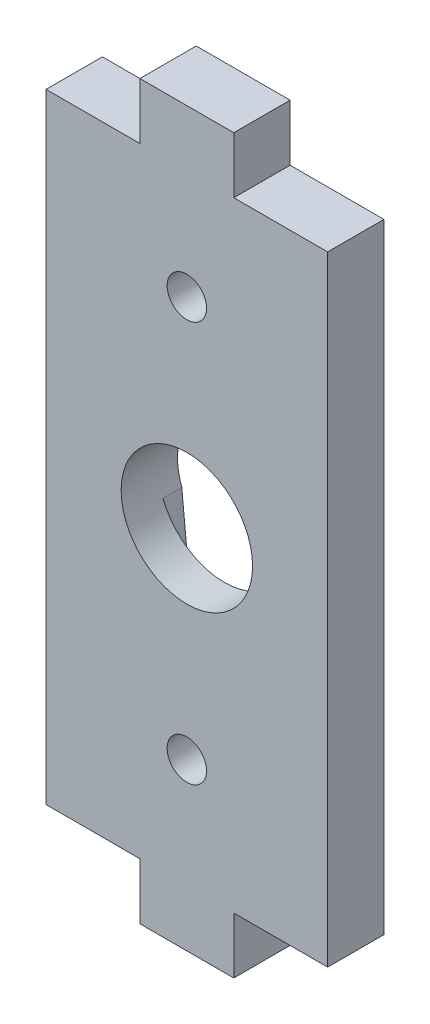
ISO-10303-21;
HEADER;
FILE_DESCRIPTION(('STEP AP214'),'2;1');
FILE_NAME('part.step','',(''),(''),'','','');
FILE_SCHEMA(('AUTOMOTIVE_DESIGN { 1 0 10303 214 1 1 1 1 }'));
ENDSEC;
DATA;
#1=APPLICATION_CONTEXT('core data for automotive mechanical design processes');
#2=APPLICATION_PROTOCOL_DEFINITION('international standard','automotive_design',2000,#1);
#3=PRODUCT_CONTEXT('',#1,'mechanical');
#4=PRODUCT('Part','Part','',(#3));
#5=PRODUCT_RELATED_PRODUCT_CATEGORY('part','',(#4));
#6=PRODUCT_DEFINITION_FORMATION('','',#4);
#7=PRODUCT_DEFINITION_CONTEXT('part definition',#1,'design');
#8=PRODUCT_DEFINITION('design','',#6,#7);
#9=PRODUCT_DEFINITION_SHAPE('','',#8);
#10=(LENGTH_UNIT() NAMED_UNIT(*) SI_UNIT(.MILLI.,.METRE.));
#11=(NAMED_UNIT(*) PLANE_ANGLE_UNIT() SI_UNIT($,.RADIAN.));
#12=(NAMED_UNIT(*) SI_UNIT($,.STERADIAN.) SOLID_ANGLE_UNIT());
#13=UNCERTAINTY_MEASURE_WITH_UNIT(LENGTH_MEASURE(1.E-05),#10,'distance_accuracy_value','');
#14=(GEOMETRIC_REPRESENTATION_CONTEXT(3) GLOBAL_UNCERTAINTY_ASSIGNED_CONTEXT((#13)) GLOBAL_UNIT_ASSIGNED_CONTEXT((#10,
#11,#12)) REPRESENTATION_CONTEXT('',''));
#15=CARTESIAN_POINT('',(0.,0.,0.));
#16=DIRECTION('',(0.,0.,1.));
#17=DIRECTION('',(1.,0.,0.));
#18=AXIS2_PLACEMENT_3D('',#15,#16,#17);
#19=CARTESIAN_POINT('',(0.,0.,0.));
#20=DIRECTION('',(0.,0.,1.));
#21=DIRECTION('',(1.,0.,0.));
#22=AXIS2_PLACEMENT_3D('',#19,#20,#21);
#23=PLANE('',#22);
#24=DIRECTION('',(0.,-1.,0.));
#25=VECTOR('',#24,1.);
#26=CARTESIAN_POINT('',(49.5000000000004,13.4999999999995,0.));
#27=LINE('',#26,#25);
#28=CARTESIAN_POINT('',(49.5000000000004,13.4999999999995,0.));
#29=VERTEX_POINT('',#28);
#30=CARTESIAN_POINT('',(49.5000000000004,10.4999999999995,0.));
#31=VERTEX_POINT('',#30);
#32=EDGE_CURVE('E247',#29,#31,#27,.T.);
#33=ORIENTED_EDGE('',*,*,#32,.F.);
#34=DIRECTION('',(1.,0.,0.));
#35=VECTOR('',#34,1.);
#36=CARTESIAN_POINT('',(44.4999999999995,13.4999999999995,0.));
#37=LINE('',#36,#35);
#38=CARTESIAN_POINT('',(44.4999999999995,13.4999999999995,0.));
#39=VERTEX_POINT('',#38);
#40=EDGE_CURVE('E252',#39,#29,#37,.T.);
#41=ORIENTED_EDGE('',*,*,#40,.F.);
#42=DIRECTION('',(0.,-1.,0.));
#43=VECTOR('',#42,1.);
#44=CARTESIAN_POINT('',(44.4999999999995,23.4999999999996,0.));
#45=LINE('',#44,#43);
#46=CARTESIAN_POINT('',(44.4999999999995,46.5000000000005,0.));
#47=VERTEX_POINT('',#46);
#48=EDGE_CURVE('E297',#47,#39,#45,.T.);
#49=ORIENTED_EDGE('',*,*,#48,.F.);
#50=DIRECTION('',(-1.,0.,0.));
#51=VECTOR('',#50,1.);
#52=CARTESIAN_POINT('',(49.5000000000004,46.5000000000005,0.));
#53=LINE('',#52,#51);
#54=CARTESIAN_POINT('',(49.5000000000004,46.5000000000005,0.));
#55=VERTEX_POINT('',#54);
#56=EDGE_CURVE('E294',#55,#47,#53,.T.);
#57=ORIENTED_EDGE('',*,*,#56,.F.);
#58=DIRECTION('',(0.,-1.,0.));
#59=VECTOR('',#58,1.);
#60=CARTESIAN_POINT('',(49.5000000000004,49.5000000000005,0.));
#61=LINE('',#60,#59);
#62=CARTESIAN_POINT('',(49.5000000000004,49.5000000000005,0.));
#63=VERTEX_POINT('',#62);
#64=EDGE_CURVE('E292',#63,#55,#61,.T.);
#65=ORIENTED_EDGE('',*,*,#64,.F.);
#66=DIRECTION('',(-1.,0.,0.));
#67=VECTOR('',#66,1.);
#68=CARTESIAN_POINT('',(54.5000000000005,49.5000000000005,0.));
#69=LINE('',#68,#67);
#70=CARTESIAN_POINT('',(54.5000000000005,49.5000000000005,0.));
#71=VERTEX_POINT('',#70);
#72=EDGE_CURVE('E290',#71,#63,#69,.T.);
#73=ORIENTED_EDGE('',*,*,#72,.F.);
#74=DIRECTION('',(0.,1.,0.));
#75=VECTOR('',#74,1.);
#76=CARTESIAN_POINT('',(54.5000000000005,46.5000000000005,0.));
#77=LINE('',#76,#75);
#78=CARTESIAN_POINT('',(54.5000000000005,46.5000000000005,0.));
#79=VERTEX_POINT('',#78);
#80=EDGE_CURVE('E288',#79,#71,#77,.T.);
#81=ORIENTED_EDGE('',*,*,#80,.F.);
#82=DIRECTION('',(-1.,0.,0.));
#83=VECTOR('',#82,1.);
#84=CARTESIAN_POINT('',(59.5000000000005,46.5000000000005,0.));
#85=LINE('',#84,#83);
#86=CARTESIAN_POINT('',(59.5000000000005,46.5000000000005,0.));
#87=VERTEX_POINT('',#86);
#88=EDGE_CURVE('E286',#87,#79,#85,.T.);
#89=ORIENTED_EDGE('',*,*,#88,.F.);
#90=DIRECTION('',(0.,1.,0.));
#91=VECTOR('',#90,1.);
#92=CARTESIAN_POINT('',(59.5000000000005,29.5000000000001,0.));
#93=LINE('',#92,#91);
#94=CARTESIAN_POINT('',(59.5000000000005,13.4999999999995,0.));
#95=VERTEX_POINT('',#94);
#96=EDGE_CURVE('E284',#95,#87,#93,.T.);
#97=ORIENTED_EDGE('',*,*,#96,.F.);
#98=DIRECTION('',(1.,0.,0.));
#99=VECTOR('',#98,1.);
#100=CARTESIAN_POINT('',(54.5000000000005,13.4999999999995,0.));
#101=LINE('',#100,#99);
#102=CARTESIAN_POINT('',(54.5000000000005,13.4999999999995,0.));
#103=VERTEX_POINT('',#102);
#104=EDGE_CURVE('E281',#103,#95,#101,.T.);
#105=ORIENTED_EDGE('',*,*,#104,.F.);
#106=DIRECTION('',(0.,1.,0.));
#107=VECTOR('',#106,1.);
#108=CARTESIAN_POINT('',(54.5000000000005,10.4999999999995,0.));
#109=LINE('',#108,#107);
#110=CARTESIAN_POINT('',(54.5000000000005,10.4999999999995,0.));
#111=VERTEX_POINT('',#110);
#112=EDGE_CURVE('E279',#111,#103,#109,.T.);
#113=ORIENTED_EDGE('',*,*,#112,.F.);
#114=DIRECTION('',(1.,0.,0.));
#115=VECTOR('',#114,1.);
#116=CARTESIAN_POINT('',(49.5000000000004,10.4999999999995,0.));
#117=LINE('',#116,#115);
#118=EDGE_CURVE('E277',#31,#111,#117,.T.);
#119=ORIENTED_EDGE('',*,*,#118,.F.);
#120=EDGE_LOOP('',(#33,#41,#49,#57,#65,#73,#81,#89,#97,#105,#113,#119));
#121=FACE_BOUND('',#120,.T.);
#122=DIRECTION('',(-0.0983012262714599,0.995156705706959,0.));
#123=VECTOR('',#122,1.);
#124=CARTESIAN_POINT('',(55.2691742077414,31.2499999998536,0.));
#125=LINE('',#124,#123);
#126=CARTESIAN_POINT('',(55.2691742077414,31.2499999998536,0.));
#127=VERTEX_POINT('',#126);
#128=CARTESIAN_POINT('',(53.9903134114006,44.1966024525005,0.));
#129=VERTEX_POINT('',#128);
#130=EDGE_CURVE('E197',#127,#129,#125,.T.);
#131=ORIENTED_EDGE('',*,*,#130,.T.);
#132=CARTESIAN_POINT('',(51.9999999999917,43.9999999999867,0.));
#133=DIRECTION('',(0.,0.,1.));
#134=DIRECTION('',(1.,0.,0.));
#135=AXIS2_PLACEMENT_3D('',#132,#133,#134);
#136=CIRCLE('',#135,1.99999999999214);
#137=CARTESIAN_POINT('',(49.9999999999995,43.9999999999867,0.));
#138=VERTEX_POINT('',#137);
#139=EDGE_CURVE('E185',#129,#138,#136,.T.);
#140=ORIENTED_EDGE('',*,*,#139,.T.);
#141=DIRECTION('',(-0.0990535328157976,-0.995082105977547,0.));
#142=VECTOR('',#141,1.);
#143=CARTESIAN_POINT('',(49.9999999999995,43.9999999999867,0.));
#144=LINE('',#143,#142);
#145=CARTESIAN_POINT('',(48.7308257923483,31.249999999981,0.));
#146=VERTEX_POINT('',#145);
#147=EDGE_CURVE('E200',#138,#146,#144,.T.);
#148=ORIENTED_EDGE('',*,*,#147,.T.);
#149=CARTESIAN_POINT('',(52.0000000000004,29.9999999999997,0.));
#150=DIRECTION('',(0.,0.,1.));
#151=DIRECTION('',(1.,0.,0.));
#152=AXIS2_PLACEMENT_3D('',#149,#150,#151);
#153=CIRCLE('',#152,3.5);
#154=CARTESIAN_POINT('',(48.7308257922595,28.7500000001457,0.));
#155=VERTEX_POINT('',#154);
#156=EDGE_CURVE('E234',#146,#155,#153,.T.);
#157=ORIENTED_EDGE('',*,*,#156,.T.);
#158=DIRECTION('',(0.0967980247525767,-0.995304045206287,0.));
#159=VECTOR('',#158,1.);
#160=CARTESIAN_POINT('',(48.7308257922595,28.7500000001457,0.));
#161=LINE('',#160,#159);
#162=CARTESIAN_POINT('',(49.9999999999995,15.7000000000006,0.));
#163=VERTEX_POINT('',#162);
#164=EDGE_CURVE('E217',#155,#163,#161,.T.);
#165=ORIENTED_EDGE('',*,*,#164,.T.);
#166=CARTESIAN_POINT('',(51.9999999999999,15.7000000000006,0.));
#167=DIRECTION('',(0.,0.,1.));
#168=DIRECTION('',(1.,0.,0.));
#169=AXIS2_PLACEMENT_3D('',#166,#167,#168);
#170=CIRCLE('',#169,2.00000000000042);
#171=CARTESIAN_POINT('',(54.0000000000004,15.7000000000006,0.));
#172=VERTEX_POINT('',#171);
#173=EDGE_CURVE('E220',#163,#172,#170,.T.);
#174=ORIENTED_EDGE('',*,*,#173,.T.);
#175=DIRECTION('',(0.0967980247467391,0.995304045206855,0.));
#176=VECTOR('',#175,1.);
#177=CARTESIAN_POINT('',(54.0000000000004,15.7000000000006,0.));
#178=LINE('',#177,#176);
#179=CARTESIAN_POINT('',(55.2691742076508,28.7500000000182,0.));
#180=VERTEX_POINT('',#179);
#181=EDGE_CURVE('E210',#172,#180,#178,.T.);
#182=ORIENTED_EDGE('',*,*,#181,.T.);
#183=EDGE_CURVE('E239',#180,#127,#153,.T.);
#184=ORIENTED_EDGE('',*,*,#183,.T.);
#185=EDGE_LOOP('',(#131,#140,#148,#157,#165,#174,#182,#184));
#186=FACE_BOUND('',#185,.T.);
#187=ADVANCED_FACE('F33',(#121,#186),#23,.F.);
#188=CARTESIAN_POINT('',(52.0000000000004,29.9999999999997,3.));
#189=DIRECTION('',(0.,0.,-1.));
#190=DIRECTION('',(-1.,0.,0.));
#191=AXIS2_PLACEMENT_3D('',#188,#189,#190);
#192=CYLINDRICAL_SURFACE('',#191,3.5);
#193=CARTESIAN_POINT('',(52.0000000000004,29.9999999999997,3.));
#194=DIRECTION('',(0.,0.,1.));
#195=DIRECTION('',(1.,0.,0.));
#196=AXIS2_PLACEMENT_3D('',#193,#194,#195);
#197=CIRCLE('',#196,3.5);
#198=CARTESIAN_POINT('',(55.5000000000004,29.9999999999997,3.));
#199=VERTEX_POINT('',#198);
#200=EDGE_CURVE('E235',#199,#199,#197,.T.);
#201=ORIENTED_EDGE('',*,*,#200,.T.);
#202=EDGE_LOOP('',(#201));
#203=FACE_BOUND('',#202,.T.);
#204=CARTESIAN_POINT('',(51.9999999999795,29.9999999999416,1.));
#205=DIRECTION('',(0.,0.,-1.));
#206=DIRECTION('',(1.,0.,0.));
#207=AXIS2_PLACEMENT_3D('',#204,#205,#206);
#208=CIRCLE('',#207,3.50000000002966);
#209=CARTESIAN_POINT('',(48.7308257923483,31.249999999981,1.));
#210=VERTEX_POINT('',#209);
#211=CARTESIAN_POINT('',(55.2691742077155,31.2499999998437,1.));
#212=VERTEX_POINT('',#211);
#213=EDGE_CURVE('E179',#210,#212,#208,.T.);
#214=ORIENTED_EDGE('',*,*,#213,.T.);
#215=DIRECTION('',(0.,0.,-1.));
#216=VECTOR('',#215,1.);
#217=CARTESIAN_POINT('',(55.2691742077414,31.2499999998536,1.));
#218=LINE('',#217,#216);
#219=EDGE_CURVE('E49',#212,#127,#218,.T.);
#220=ORIENTED_EDGE('',*,*,#219,.T.);
#221=ORIENTED_EDGE('',*,*,#183,.F.);
#222=DIRECTION('',(0.,0.,-1.));
#223=VECTOR('',#222,1.);
#224=CARTESIAN_POINT('',(55.2691742076508,28.7500000000182,1.));
#225=LINE('',#224,#223);
#226=CARTESIAN_POINT('',(55.2691742076508,28.7500000000182,1.));
#227=VERTEX_POINT('',#226);
#228=EDGE_CURVE('E216',#227,#180,#225,.T.);
#229=ORIENTED_EDGE('',*,*,#228,.F.);
#230=CARTESIAN_POINT('',(51.9999999999795,29.9999999999416,1.));
#231=DIRECTION('',(0.,0.,-1.));
#232=DIRECTION('',(1.,0.,0.));
#233=AXIS2_PLACEMENT_3D('',#230,#231,#232);
#234=CIRCLE('',#233,3.49999999998736);
#235=CARTESIAN_POINT('',(48.7308257922853,28.7500000001555,1.));
#236=VERTEX_POINT('',#235);
#237=EDGE_CURVE('E206',#227,#236,#234,.T.);
#238=ORIENTED_EDGE('',*,*,#237,.T.);
#239=DIRECTION('',(0.,0.,-1.));
#240=VECTOR('',#239,1.);
#241=CARTESIAN_POINT('',(48.7308257922595,28.7500000001457,1.));
#242=LINE('',#241,#240);
#243=EDGE_CURVE('E57',#236,#155,#242,.T.);
#244=ORIENTED_EDGE('',*,*,#243,.T.);
#245=ORIENTED_EDGE('',*,*,#156,.F.);
#246=DIRECTION('',(0.,0.,-1.));
#247=VECTOR('',#246,1.);
#248=CARTESIAN_POINT('',(48.7308257923483,31.249999999981,1.));
#249=LINE('',#248,#247);
#250=EDGE_CURVE('E193',#210,#146,#249,.T.);
#251=ORIENTED_EDGE('',*,*,#250,.F.);
#252=EDGE_LOOP('',(#214,#220,#221,#229,#238,#244,#245,#251));
#253=FACE_BOUND('',#252,.T.);
#254=ADVANCED_FACE('F399',(#203,#253),#192,.F.);
#255=CARTESIAN_POINT('',(0.,0.,3.));
#256=DIRECTION('',(0.,0.,1.));
#257=DIRECTION('',(1.,0.,0.));
#258=AXIS2_PLACEMENT_3D('',#255,#256,#257);
#259=PLANE('',#258);
#260=CARTESIAN_POINT('',(52.0000000000004,19.3277705465005,3.));
#261=DIRECTION('',(0.,0.,1.));
#262=DIRECTION('',(1.,0.,0.));
#263=AXIS2_PLACEMENT_3D('',#260,#261,#262);
#264=CIRCLE('',#263,1.05);
#265=CARTESIAN_POINT('',(53.0500000000004,19.3277705465005,3.));
#266=VERTEX_POINT('',#265);
#267=EDGE_CURVE('E238',#266,#266,#264,.T.);
#268=ORIENTED_EDGE('',*,*,#267,.F.);
#269=EDGE_LOOP('',(#268));
#270=FACE_BOUND('',#269,.T.);
#271=DIRECTION('',(0.,-1.,0.));
#272=VECTOR('',#271,1.);
#273=CARTESIAN_POINT('',(49.5000000000004,13.4999999999995,3.));
#274=LINE('',#273,#272);
#275=CARTESIAN_POINT('',(49.5000000000004,13.4999999999995,3.));
#276=VERTEX_POINT('',#275);
#277=CARTESIAN_POINT('',(49.5000000000004,10.4999999999995,3.));
#278=VERTEX_POINT('',#277);
#279=EDGE_CURVE('E248',#276,#278,#274,.T.);
#280=ORIENTED_EDGE('',*,*,#279,.T.);
#281=DIRECTION('',(1.,0.,0.));
#282=VECTOR('',#281,1.);
#283=CARTESIAN_POINT('',(49.5000000000004,10.4999999999995,3.));
#284=LINE('',#283,#282);
#285=CARTESIAN_POINT('',(54.5000000000005,10.4999999999995,3.));
#286=VERTEX_POINT('',#285);
#287=EDGE_CURVE('E251',#278,#286,#284,.T.);
#288=ORIENTED_EDGE('',*,*,#287,.T.);
#289=DIRECTION('',(0.,1.,0.));
#290=VECTOR('',#289,1.);
#291=CARTESIAN_POINT('',(54.5000000000005,10.4999999999995,3.));
#292=LINE('',#291,#290);
#293=CARTESIAN_POINT('',(54.5000000000005,13.4999999999995,3.));
#294=VERTEX_POINT('',#293);
#295=EDGE_CURVE('E254',#286,#294,#292,.T.);
#296=ORIENTED_EDGE('',*,*,#295,.T.);
#297=DIRECTION('',(1.,0.,0.));
#298=VECTOR('',#297,1.);
#299=CARTESIAN_POINT('',(54.5000000000005,13.4999999999995,3.));
#300=LINE('',#299,#298);
#301=CARTESIAN_POINT('',(59.5000000000005,13.4999999999995,3.));
#302=VERTEX_POINT('',#301);
#303=EDGE_CURVE('E256',#294,#302,#300,.T.);
#304=ORIENTED_EDGE('',*,*,#303,.T.);
#305=DIRECTION('',(0.,1.,0.));
#306=VECTOR('',#305,1.);
#307=CARTESIAN_POINT('',(59.5000000000005,13.4999999999995,3.));
#308=LINE('',#307,#306);
#309=CARTESIAN_POINT('',(59.5000000000005,46.5000000000005,3.));
#310=VERTEX_POINT('',#309);
#311=EDGE_CURVE('E258',#302,#310,#308,.T.);
#312=ORIENTED_EDGE('',*,*,#311,.T.);
#313=DIRECTION('',(-1.,0.,0.));
#314=VECTOR('',#313,1.);
#315=CARTESIAN_POINT('',(59.5000000000005,46.5000000000005,3.));
#316=LINE('',#315,#314);
#317=CARTESIAN_POINT('',(54.5000000000005,46.5000000000005,3.));
#318=VERTEX_POINT('',#317);
#319=EDGE_CURVE('E260',#310,#318,#316,.T.);
#320=ORIENTED_EDGE('',*,*,#319,.T.);
#321=DIRECTION('',(0.,1.,0.));
#322=VECTOR('',#321,1.);
#323=CARTESIAN_POINT('',(54.5000000000005,46.5000000000005,3.));
#324=LINE('',#323,#322);
#325=CARTESIAN_POINT('',(54.5000000000005,49.5000000000005,3.));
#326=VERTEX_POINT('',#325);
#327=EDGE_CURVE('E262',#318,#326,#324,.T.);
#328=ORIENTED_EDGE('',*,*,#327,.T.);
#329=DIRECTION('',(-1.,0.,0.));
#330=VECTOR('',#329,1.);
#331=CARTESIAN_POINT('',(54.5000000000005,49.5000000000005,3.));
#332=LINE('',#331,#330);
#333=CARTESIAN_POINT('',(49.5000000000004,49.5000000000005,3.));
#334=VERTEX_POINT('',#333);
#335=EDGE_CURVE('E264',#326,#334,#332,.T.);
#336=ORIENTED_EDGE('',*,*,#335,.T.);
#337=DIRECTION('',(0.,-1.,0.));
#338=VECTOR('',#337,1.);
#339=CARTESIAN_POINT('',(49.5000000000004,49.5000000000005,3.));
#340=LINE('',#339,#338);
#341=CARTESIAN_POINT('',(49.5000000000004,46.5000000000005,3.));
#342=VERTEX_POINT('',#341);
#343=EDGE_CURVE('E266',#334,#342,#340,.T.);
#344=ORIENTED_EDGE('',*,*,#343,.T.);
#345=DIRECTION('',(-1.,0.,0.));
#346=VECTOR('',#345,1.);
#347=CARTESIAN_POINT('',(49.5000000000004,46.5000000000005,3.));
#348=LINE('',#347,#346);
#349=CARTESIAN_POINT('',(44.4999999999995,46.5000000000005,3.));
#350=VERTEX_POINT('',#349);
#351=EDGE_CURVE('E268',#342,#350,#348,.T.);
#352=ORIENTED_EDGE('',*,*,#351,.T.);
#353=DIRECTION('',(0.,-1.,0.));
#354=VECTOR('',#353,1.);
#355=CARTESIAN_POINT('',(44.4999999999995,46.5000000000005,3.));
#356=LINE('',#355,#354);
#357=CARTESIAN_POINT('',(44.4999999999995,13.4999999999995,3.));
#358=VERTEX_POINT('',#357);
#359=EDGE_CURVE('E270',#350,#358,#356,.T.);
#360=ORIENTED_EDGE('',*,*,#359,.T.);
#361=DIRECTION('',(1.,0.,0.));
#362=VECTOR('',#361,1.);
#363=CARTESIAN_POINT('',(44.4999999999995,13.4999999999995,3.));
#364=LINE('',#363,#362);
#365=EDGE_CURVE('E272',#358,#276,#364,.T.);
#366=ORIENTED_EDGE('',*,*,#365,.T.);
#367=EDGE_LOOP('',(#280,#288,#296,#304,#312,#320,#328,#336,#344,#352,#360,#366));
#368=FACE_BOUND('',#367,.T.);
#369=CARTESIAN_POINT('',(52.0000000000004,40.6722294535005,3.));
#370=DIRECTION('',(0.,0.,1.));
#371=DIRECTION('',(1.,0.,0.));
#372=AXIS2_PLACEMENT_3D('',#369,#370,#371);
#373=CIRCLE('',#372,1.05);
#374=CARTESIAN_POINT('',(53.0500000000004,40.6722294535005,3.));
#375=VERTEX_POINT('',#374);
#376=EDGE_CURVE('E244',#375,#375,#373,.T.);
#377=ORIENTED_EDGE('',*,*,#376,.F.);
#378=EDGE_LOOP('',(#377));
#379=FACE_BOUND('',#378,.T.);
#380=ORIENTED_EDGE('',*,*,#200,.F.);
#381=EDGE_LOOP('',(#380));
#382=FACE_BOUND('',#381,.T.);
#383=ADVANCED_FACE('F352',(#270,#368,#379,#382),#259,.T.);
#384=CARTESIAN_POINT('',(49.5000000000004,13.4999999999995,3.));
#385=DIRECTION('',(1.,0.,0.));
#386=DIRECTION('',(0.,0.,-1.));
#387=AXIS2_PLACEMENT_3D('',#384,#385,#386);
#388=PLANE('',#387);
#389=ORIENTED_EDGE('',*,*,#32,.T.);
#390=DIRECTION('',(0.,0.,-1.));
#391=VECTOR('',#390,1.);
#392=CARTESIAN_POINT('',(49.5000000000004,10.4999999999995,3.));
#393=LINE('',#392,#391);
#394=EDGE_CURVE('E11',#278,#31,#393,.T.);
#395=ORIENTED_EDGE('',*,*,#394,.F.);
#396=ORIENTED_EDGE('',*,*,#279,.F.);
#397=DIRECTION('',(0.,0.,-1.));
#398=VECTOR('',#397,1.);
#399=CARTESIAN_POINT('',(49.5000000000004,13.4999999999995,3.));
#400=LINE('',#399,#398);
#401=EDGE_CURVE('E274',#276,#29,#400,.T.);
#402=ORIENTED_EDGE('',*,*,#401,.T.);
#403=EDGE_LOOP('',(#389,#395,#396,#402));
#404=FACE_BOUND('',#403,.T.);
#405=ADVANCED_FACE('F35',(#404),#388,.F.);
#406=CARTESIAN_POINT('',(49.5000000000004,10.4999999999995,3.));
#407=DIRECTION('',(0.,1.,0.));
#408=DIRECTION('',(0.,0.,1.));
#409=AXIS2_PLACEMENT_3D('',#406,#407,#408);
#410=PLANE('',#409);
#411=ORIENTED_EDGE('',*,*,#118,.T.);
#412=DIRECTION('',(0.,0.,-1.));
#413=VECTOR('',#412,1.);
#414=CARTESIAN_POINT('',(54.5000000000005,10.4999999999995,3.));
#415=LINE('',#414,#413);
#416=EDGE_CURVE('E42',#286,#111,#415,.T.);
#417=ORIENTED_EDGE('',*,*,#416,.F.);
#418=ORIENTED_EDGE('',*,*,#287,.F.);
#419=ORIENTED_EDGE('',*,*,#394,.T.);
#420=EDGE_LOOP('',(#411,#417,#418,#419));
#421=FACE_BOUND('',#420,.T.);
#422=ADVANCED_FACE('F357',(#421),#410,.F.);
#423=CARTESIAN_POINT('',(54.5000000000005,10.4999999999995,3.));
#424=DIRECTION('',(-1.,0.,0.));
#425=DIRECTION('',(0.,0.,1.));
#426=AXIS2_PLACEMENT_3D('',#423,#424,#425);
#427=PLANE('',#426);
#428=ORIENTED_EDGE('',*,*,#112,.T.);
#429=DIRECTION('',(0.,0.,-1.));
#430=VECTOR('',#429,1.);
#431=CARTESIAN_POINT('',(54.5000000000005,13.4999999999995,3.));
#432=LINE('',#431,#430);
#433=EDGE_CURVE('E326',#294,#103,#432,.T.);
#434=ORIENTED_EDGE('',*,*,#433,.F.);
#435=ORIENTED_EDGE('',*,*,#295,.F.);
#436=ORIENTED_EDGE('',*,*,#416,.T.);
#437=EDGE_LOOP('',(#428,#434,#435,#436));
#438=FACE_BOUND('',#437,.T.);
#439=ADVANCED_FACE('F334',(#438),#427,.F.);
#440=CARTESIAN_POINT('',(54.5000000000005,13.4999999999995,3.));
#441=DIRECTION('',(0.,1.,0.));
#442=DIRECTION('',(0.,0.,1.));
#443=AXIS2_PLACEMENT_3D('',#440,#441,#442);
#444=PLANE('',#443);
#445=ORIENTED_EDGE('',*,*,#104,.T.);
#446=DIRECTION('',(0.,0.,-1.));
#447=VECTOR('',#446,1.);
#448=CARTESIAN_POINT('',(59.5000000000005,13.4999999999995,3.));
#449=LINE('',#448,#447);
#450=EDGE_CURVE('E323',#302,#95,#449,.T.);
#451=ORIENTED_EDGE('',*,*,#450,.F.);
#452=ORIENTED_EDGE('',*,*,#303,.F.);
#453=ORIENTED_EDGE('',*,*,#433,.T.);
#454=EDGE_LOOP('',(#445,#451,#452,#453));
#455=FACE_BOUND('',#454,.T.);
#456=ADVANCED_FACE('F344',(#455),#444,.F.);
#457=CARTESIAN_POINT('',(59.5000000000005,29.5000000000001,3.));
#458=DIRECTION('',(-1.,0.,0.));
#459=DIRECTION('',(0.,0.,1.));
#460=AXIS2_PLACEMENT_3D('',#457,#458,#459);
#461=PLANE('',#460);
#462=ORIENTED_EDGE('',*,*,#96,.T.);
#463=DIRECTION('',(0.,0.,-1.));
#464=VECTOR('',#463,1.);
#465=CARTESIAN_POINT('',(59.5000000000005,46.5000000000005,3.));
#466=LINE('',#465,#464);
#467=EDGE_CURVE('E320',#310,#87,#466,.T.);
#468=ORIENTED_EDGE('',*,*,#467,.F.);
#469=ORIENTED_EDGE('',*,*,#311,.F.);
#470=ORIENTED_EDGE('',*,*,#450,.T.);
#471=EDGE_LOOP('',(#462,#468,#469,#470));
#472=FACE_BOUND('',#471,.T.);
#473=ADVANCED_FACE('F348',(#472),#461,.F.);
#474=CARTESIAN_POINT('',(59.5000000000005,46.5000000000005,3.));
#475=DIRECTION('',(0.,-1.,0.));
#476=DIRECTION('',(0.,0.,-1.));
#477=AXIS2_PLACEMENT_3D('',#474,#475,#476);
#478=PLANE('',#477);
#479=ORIENTED_EDGE('',*,*,#88,.T.);
#480=DIRECTION('',(0.,0.,-1.));
#481=VECTOR('',#480,1.);
#482=CARTESIAN_POINT('',(54.5000000000005,46.5000000000005,3.));
#483=LINE('',#482,#481);
#484=EDGE_CURVE('E317',#318,#79,#483,.T.);
#485=ORIENTED_EDGE('',*,*,#484,.F.);
#486=ORIENTED_EDGE('',*,*,#319,.F.);
#487=ORIENTED_EDGE('',*,*,#467,.T.);
#488=EDGE_LOOP('',(#479,#485,#486,#487));
#489=FACE_BOUND('',#488,.T.);
#490=ADVANCED_FACE('F389',(#489),#478,.F.);
#491=CARTESIAN_POINT('',(54.5000000000005,46.5000000000005,3.));
#492=DIRECTION('',(-1.,0.,0.));
#493=DIRECTION('',(0.,0.,1.));
#494=AXIS2_PLACEMENT_3D('',#491,#492,#493);
#495=PLANE('',#494);
#496=ORIENTED_EDGE('',*,*,#80,.T.);
#497=DIRECTION('',(0.,0.,-1.));
#498=VECTOR('',#497,1.);
#499=CARTESIAN_POINT('',(54.5000000000005,49.5000000000005,3.));
#500=LINE('',#499,#498);
#501=EDGE_CURVE('E314',#326,#71,#500,.T.);
#502=ORIENTED_EDGE('',*,*,#501,.F.);
#503=ORIENTED_EDGE('',*,*,#327,.F.);
#504=ORIENTED_EDGE('',*,*,#484,.T.);
#505=EDGE_LOOP('',(#496,#502,#503,#504));
#506=FACE_BOUND('',#505,.T.);
#507=ADVANCED_FACE('F387',(#506),#495,.F.);
#508=CARTESIAN_POINT('',(54.5000000000005,49.5000000000005,3.));
#509=DIRECTION('',(0.,-1.,0.));
#510=DIRECTION('',(0.,0.,-1.));
#511=AXIS2_PLACEMENT_3D('',#508,#509,#510);
#512=PLANE('',#511);
#513=ORIENTED_EDGE('',*,*,#72,.T.);
#514=DIRECTION('',(0.,0.,-1.));
#515=VECTOR('',#514,1.);
#516=CARTESIAN_POINT('',(49.5000000000004,49.5000000000005,3.));
#517=LINE('',#516,#515);
#518=EDGE_CURVE('E311',#334,#63,#517,.T.);
#519=ORIENTED_EDGE('',*,*,#518,.F.);
#520=ORIENTED_EDGE('',*,*,#335,.F.);
#521=ORIENTED_EDGE('',*,*,#501,.T.);
#522=EDGE_LOOP('',(#513,#519,#520,#521));
#523=FACE_BOUND('',#522,.T.);
#524=ADVANCED_FACE('F383',(#523),#512,.F.);
#525=CARTESIAN_POINT('',(49.5000000000004,49.5000000000005,3.));
#526=DIRECTION('',(1.,0.,0.));
#527=DIRECTION('',(0.,0.,-1.));
#528=AXIS2_PLACEMENT_3D('',#525,#526,#527);
#529=PLANE('',#528);
#530=ORIENTED_EDGE('',*,*,#64,.T.);
#531=DIRECTION('',(0.,0.,-1.));
#532=VECTOR('',#531,1.);
#533=CARTESIAN_POINT('',(49.5000000000004,46.5000000000005,3.));
#534=LINE('',#533,#532);
#535=EDGE_CURVE('E308',#342,#55,#534,.T.);
#536=ORIENTED_EDGE('',*,*,#535,.F.);
#537=ORIENTED_EDGE('',*,*,#343,.F.);
#538=ORIENTED_EDGE('',*,*,#518,.T.);
#539=EDGE_LOOP('',(#530,#536,#537,#538));
#540=FACE_BOUND('',#539,.T.);
#541=ADVANCED_FACE('F378',(#540),#529,.F.);
#542=CARTESIAN_POINT('',(49.5000000000004,46.5000000000005,3.));
#543=DIRECTION('',(0.,-1.,0.));
#544=DIRECTION('',(0.,0.,-1.));
#545=AXIS2_PLACEMENT_3D('',#542,#543,#544);
#546=PLANE('',#545);
#547=ORIENTED_EDGE('',*,*,#56,.T.);
#548=DIRECTION('',(0.,0.,-1.));
#549=VECTOR('',#548,1.);
#550=CARTESIAN_POINT('',(44.4999999999995,46.5000000000005,3.));
#551=LINE('',#550,#549);
#552=EDGE_CURVE('E305',#350,#47,#551,.T.);
#553=ORIENTED_EDGE('',*,*,#552,.F.);
#554=ORIENTED_EDGE('',*,*,#351,.F.);
#555=ORIENTED_EDGE('',*,*,#535,.T.);
#556=EDGE_LOOP('',(#547,#553,#554,#555));
#557=FACE_BOUND('',#556,.T.);
#558=ADVANCED_FACE('F372',(#557),#546,.F.);
#559=CARTESIAN_POINT('',(44.4999999999995,23.4999999999996,3.));
#560=DIRECTION('',(1.,0.,0.));
#561=DIRECTION('',(0.,0.,-1.));
#562=AXIS2_PLACEMENT_3D('',#559,#560,#561);
#563=PLANE('',#562);
#564=ORIENTED_EDGE('',*,*,#48,.T.);
#565=DIRECTION('',(0.,0.,-1.));
#566=VECTOR('',#565,1.);
#567=CARTESIAN_POINT('',(44.4999999999995,13.4999999999995,3.));
#568=LINE('',#567,#566);
#569=EDGE_CURVE('E302',#358,#39,#568,.T.);
#570=ORIENTED_EDGE('',*,*,#569,.F.);
#571=ORIENTED_EDGE('',*,*,#359,.F.);
#572=ORIENTED_EDGE('',*,*,#552,.T.);
#573=EDGE_LOOP('',(#564,#570,#571,#572));
#574=FACE_BOUND('',#573,.T.);
#575=ADVANCED_FACE('F368',(#574),#563,.F.);
#576=CARTESIAN_POINT('',(44.4999999999995,13.4999999999995,3.));
#577=DIRECTION('',(0.,1.,0.));
#578=DIRECTION('',(0.,0.,1.));
#579=AXIS2_PLACEMENT_3D('',#576,#577,#578);
#580=PLANE('',#579);
#581=ORIENTED_EDGE('',*,*,#40,.T.);
#582=ORIENTED_EDGE('',*,*,#401,.F.);
#583=ORIENTED_EDGE('',*,*,#365,.F.);
#584=ORIENTED_EDGE('',*,*,#569,.T.);
#585=EDGE_LOOP('',(#581,#582,#583,#584));
#586=FACE_BOUND('',#585,.T.);
#587=ADVANCED_FACE('F363',(#586),#580,.F.);
#588=CARTESIAN_POINT('',(52.0000000000004,40.6722294535005,3.));
#589=DIRECTION('',(0.,0.,-1.));
#590=DIRECTION('',(-1.,0.,0.));
#591=AXIS2_PLACEMENT_3D('',#588,#589,#590);
#592=CYLINDRICAL_SURFACE('',#591,1.05);
#593=CARTESIAN_POINT('',(52.0000000000004,40.6722294535005,1.));
#594=DIRECTION('',(0.,0.,1.));
#595=DIRECTION('',(1.,0.,0.));
#596=AXIS2_PLACEMENT_3D('',#593,#594,#595);
#597=CIRCLE('',#596,1.05);
#598=CARTESIAN_POINT('',(53.0500000000004,40.6722294535005,1.));
#599=VERTEX_POINT('',#598);
#600=EDGE_CURVE('E37',#599,#599,#597,.T.);
#601=ORIENTED_EDGE('',*,*,#600,.F.);
#602=EDGE_LOOP('',(#601));
#603=FACE_BOUND('',#602,.T.);
#604=ORIENTED_EDGE('',*,*,#376,.T.);
#605=EDGE_LOOP('',(#604));
#606=FACE_BOUND('',#605,.T.);
#607=ADVANCED_FACE('F411',(#603,#606),#592,.F.);
#608=CARTESIAN_POINT('',(52.0000000000004,19.3277705465005,3.));
#609=DIRECTION('',(0.,0.,-1.));
#610=DIRECTION('',(-1.,0.,0.));
#611=AXIS2_PLACEMENT_3D('',#608,#609,#610);
#612=CYLINDRICAL_SURFACE('',#611,1.05);
#613=CARTESIAN_POINT('',(52.0000000000004,19.3277705465005,1.));
#614=DIRECTION('',(0.,0.,1.));
#615=DIRECTION('',(1.,0.,0.));
#616=AXIS2_PLACEMENT_3D('',#613,#614,#615);
#617=CIRCLE('',#616,1.05);
#618=CARTESIAN_POINT('',(53.0500000000004,19.3277705465005,1.));
#619=VERTEX_POINT('',#618);
#620=EDGE_CURVE('E231',#619,#619,#617,.T.);
#621=ORIENTED_EDGE('',*,*,#620,.F.);
#622=EDGE_LOOP('',(#621));
#623=FACE_BOUND('',#622,.T.);
#624=ORIENTED_EDGE('',*,*,#267,.T.);
#625=EDGE_LOOP('',(#624));
#626=FACE_BOUND('',#625,.T.);
#627=ADVANCED_FACE('F445',(#623,#626),#612,.F.);
#628=CARTESIAN_POINT('',(48.7308257922595,28.7500000001457,1.));
#629=DIRECTION('',(0.995304045206288,0.0967980247525767,0.));
#630=DIRECTION('',(-0.0967980247525767,0.995304045206288,0.));
#631=AXIS2_PLACEMENT_3D('',#628,#629,#630);
#632=PLANE('',#631);
#633=ORIENTED_EDGE('',*,*,#164,.F.);
#634=ORIENTED_EDGE('',*,*,#243,.F.);
#635=DIRECTION('',(0.0967980247525767,-0.995304045206287,0.));
#636=VECTOR('',#635,1.);
#637=CARTESIAN_POINT('',(48.7308257922595,28.7500000001457,1.));
#638=LINE('',#637,#636);
#639=CARTESIAN_POINT('',(49.9999999999995,15.7000000000006,1.));
#640=VERTEX_POINT('',#639);
#641=EDGE_CURVE('E209',#236,#640,#638,.T.);
#642=ORIENTED_EDGE('',*,*,#641,.T.);
#643=DIRECTION('',(0.,0.,-1.));
#644=VECTOR('',#643,1.);
#645=CARTESIAN_POINT('',(49.9999999999995,15.7000000000006,1.));
#646=LINE('',#645,#644);
#647=EDGE_CURVE('E228',#640,#163,#646,.T.);
#648=ORIENTED_EDGE('',*,*,#647,.T.);
#649=EDGE_LOOP('',(#633,#634,#642,#648));
#650=FACE_BOUND('',#649,.T.);
#651=ADVANCED_FACE('F453',(#650),#632,.T.);
#652=CARTESIAN_POINT('',(51.9999999999999,15.7000000000006,1.));
#653=DIRECTION('',(0.,0.,-1.));
#654=DIRECTION('',(-1.,0.,0.));
#655=AXIS2_PLACEMENT_3D('',#652,#653,#654);
#656=CYLINDRICAL_SURFACE('',#655,2.00000000000042);
#657=ORIENTED_EDGE('',*,*,#173,.F.);
#658=ORIENTED_EDGE('',*,*,#647,.F.);
#659=CARTESIAN_POINT('',(51.9999999999999,15.7000000000006,1.));
#660=DIRECTION('',(0.,0.,1.));
#661=DIRECTION('',(1.,0.,0.));
#662=AXIS2_PLACEMENT_3D('',#659,#660,#661);
#663=CIRCLE('',#662,2.00000000000042);
#664=CARTESIAN_POINT('',(54.0000000000004,15.7000000000006,1.));
#665=VERTEX_POINT('',#664);
#666=EDGE_CURVE('E212',#640,#665,#663,.T.);
#667=ORIENTED_EDGE('',*,*,#666,.T.);
#668=DIRECTION('',(0.,0.,-1.));
#669=VECTOR('',#668,1.);
#670=CARTESIAN_POINT('',(54.0000000000004,15.7000000000006,1.));
#671=LINE('',#670,#669);
#672=EDGE_CURVE('E226',#665,#172,#671,.T.);
#673=ORIENTED_EDGE('',*,*,#672,.T.);
#674=EDGE_LOOP('',(#657,#658,#667,#673));
#675=FACE_BOUND('',#674,.T.);
#676=ADVANCED_FACE('F461',(#675),#656,.F.);
#677=CARTESIAN_POINT('',(54.0000000000004,15.7000000000006,1.));
#678=DIRECTION('',(-0.995304045206855,0.0967980247467391,0.));
#679=DIRECTION('',(-0.0967980247467391,-0.995304045206855,0.));
#680=AXIS2_PLACEMENT_3D('',#677,#678,#679);
#681=PLANE('',#680);
#682=ORIENTED_EDGE('',*,*,#181,.F.);
#683=ORIENTED_EDGE('',*,*,#672,.F.);
#684=DIRECTION('',(0.0967980247467391,0.995304045206855,0.));
#685=VECTOR('',#684,1.);
#686=CARTESIAN_POINT('',(54.0000000000004,15.7000000000006,1.));
#687=LINE('',#686,#685);
#688=EDGE_CURVE('E214',#665,#227,#687,.T.);
#689=ORIENTED_EDGE('',*,*,#688,.T.);
#690=ORIENTED_EDGE('',*,*,#228,.T.);
#691=EDGE_LOOP('',(#682,#683,#689,#690));
#692=FACE_BOUND('',#691,.T.);
#693=ADVANCED_FACE('F468',(#692),#681,.T.);
#694=CARTESIAN_POINT('',(51.9999999999795,29.9999999999416,1.));
#695=DIRECTION('',(0.,0.,1.));
#696=DIRECTION('',(1.,0.,0.));
#697=AXIS2_PLACEMENT_3D('',#694,#695,#696);
#698=PLANE('',#697);
#699=ORIENTED_EDGE('',*,*,#620,.T.);
#700=EDGE_LOOP('',(#699));
#701=FACE_BOUND('',#700,.T.);
#702=ORIENTED_EDGE('',*,*,#237,.F.);
#703=ORIENTED_EDGE('',*,*,#688,.F.);
#704=ORIENTED_EDGE('',*,*,#666,.F.);
#705=ORIENTED_EDGE('',*,*,#641,.F.);
#706=EDGE_LOOP('',(#702,#703,#704,#705));
#707=FACE_BOUND('',#706,.T.);
#708=ADVANCED_FACE('F476',(#701,#707),#698,.F.);
#709=CARTESIAN_POINT('',(55.2691742077414,31.2499999998536,1.));
#710=DIRECTION('',(-0.995156705706959,-0.0983012262714599,0.));
#711=DIRECTION('',(0.0983012262714599,-0.995156705706959,0.));
#712=AXIS2_PLACEMENT_3D('',#709,#710,#711);
#713=PLANE('',#712);
#714=ORIENTED_EDGE('',*,*,#130,.F.);
#715=ORIENTED_EDGE('',*,*,#219,.F.);
#716=DIRECTION('',(-0.0983012262714599,0.995156705706959,0.));
#717=VECTOR('',#716,1.);
#718=CARTESIAN_POINT('',(55.2691742077414,31.2499999998536,1.));
#719=LINE('',#718,#717);
#720=CARTESIAN_POINT('',(53.9903134114006,44.1966024525005,1.));
#721=VERTEX_POINT('',#720);
#722=EDGE_CURVE('E169',#212,#721,#719,.T.);
#723=ORIENTED_EDGE('',*,*,#722,.T.);
#724=DIRECTION('',(0.,0.,-1.));
#725=VECTOR('',#724,1.);
#726=CARTESIAN_POINT('',(53.9903134114006,44.1966024525005,1.));
#727=LINE('',#726,#725);
#728=EDGE_CURVE('E172',#721,#129,#727,.T.);
#729=ORIENTED_EDGE('',*,*,#728,.T.);
#730=EDGE_LOOP('',(#714,#715,#723,#729));
#731=FACE_BOUND('',#730,.T.);
#732=ADVANCED_FACE('F171',(#731),#713,.T.);
#733=CARTESIAN_POINT('',(51.9999999999917,43.9999999999867,1.));
#734=DIRECTION('',(0.,0.,-1.));
#735=DIRECTION('',(-1.,0.,0.));
#736=AXIS2_PLACEMENT_3D('',#733,#734,#735);
#737=CYLINDRICAL_SURFACE('',#736,1.99999999999214);
#738=ORIENTED_EDGE('',*,*,#139,.F.);
#739=ORIENTED_EDGE('',*,*,#728,.F.);
#740=CARTESIAN_POINT('',(51.9999999999917,43.9999999999867,1.));
#741=DIRECTION('',(0.,0.,1.));
#742=DIRECTION('',(1.,0.,0.));
#743=AXIS2_PLACEMENT_3D('',#740,#741,#742);
#744=CIRCLE('',#743,1.99999999999214);
#745=CARTESIAN_POINT('',(49.9999999999995,43.9999999999867,1.));
#746=VERTEX_POINT('',#745);
#747=EDGE_CURVE('E178',#721,#746,#744,.T.);
#748=ORIENTED_EDGE('',*,*,#747,.T.);
#749=DIRECTION('',(0.,0.,-1.));
#750=VECTOR('',#749,1.);
#751=CARTESIAN_POINT('',(49.9999999999995,43.9999999999867,1.));
#752=LINE('',#751,#750);
#753=EDGE_CURVE('E187',#746,#138,#752,.T.);
#754=ORIENTED_EDGE('',*,*,#753,.T.);
#755=EDGE_LOOP('',(#738,#739,#748,#754));
#756=FACE_BOUND('',#755,.T.);
#757=ADVANCED_FACE('F182',(#756),#737,.F.);
#758=CARTESIAN_POINT('',(49.9999999999995,43.9999999999867,1.));
#759=DIRECTION('',(0.995082105977547,-0.0990535328157976,0.));
#760=DIRECTION('',(0.0990535328157976,0.995082105977547,0.));
#761=AXIS2_PLACEMENT_3D('',#758,#759,#760);
#762=PLANE('',#761);
#763=ORIENTED_EDGE('',*,*,#147,.F.);
#764=ORIENTED_EDGE('',*,*,#753,.F.);
#765=DIRECTION('',(-0.0990535328157976,-0.995082105977547,0.));
#766=VECTOR('',#765,1.);
#767=CARTESIAN_POINT('',(49.9999999999995,43.9999999999867,1.));
#768=LINE('',#767,#766);
#769=EDGE_CURVE('E191',#746,#210,#768,.T.);
#770=ORIENTED_EDGE('',*,*,#769,.T.);
#771=ORIENTED_EDGE('',*,*,#250,.T.);
#772=EDGE_LOOP('',(#763,#764,#770,#771));
#773=FACE_BOUND('',#772,.T.);
#774=ADVANCED_FACE('F497',(#773),#762,.T.);
#775=CARTESIAN_POINT('',(51.9999999999795,29.9999999999416,1.));
#776=DIRECTION('',(0.,0.,1.));
#777=DIRECTION('',(1.,0.,0.));
#778=AXIS2_PLACEMENT_3D('',#775,#776,#777);
#779=PLANE('',#778);
#780=ORIENTED_EDGE('',*,*,#600,.T.);
#781=EDGE_LOOP('',(#780));
#782=FACE_BOUND('',#781,.T.);
#783=ORIENTED_EDGE('',*,*,#213,.F.);
#784=ORIENTED_EDGE('',*,*,#769,.F.);
#785=ORIENTED_EDGE('',*,*,#747,.F.);
#786=ORIENTED_EDGE('',*,*,#722,.F.);
#787=EDGE_LOOP('',(#783,#784,#785,#786));
#788=FACE_BOUND('',#787,.T.);
#789=ADVANCED_FACE('F190',(#782,#788),#779,.F.);
#790=CLOSED_SHELL('',(#187,#254,#383,#405,#422,#439,#456,#473,#490,#507,#524,#541,#558,#575,
#587,#607,#627,#651,#676,#693,#708,#732,#757,#774,#789));
#791=MANIFOLD_SOLID_BREP('B2',#790);
#792=ADVANCED_BREP_SHAPE_REPRESENTATION('',(#18,#791),#14);
#793=SHAPE_DEFINITION_REPRESENTATION(#9,#792);
ENDSEC;
END-ISO-10303-21;
